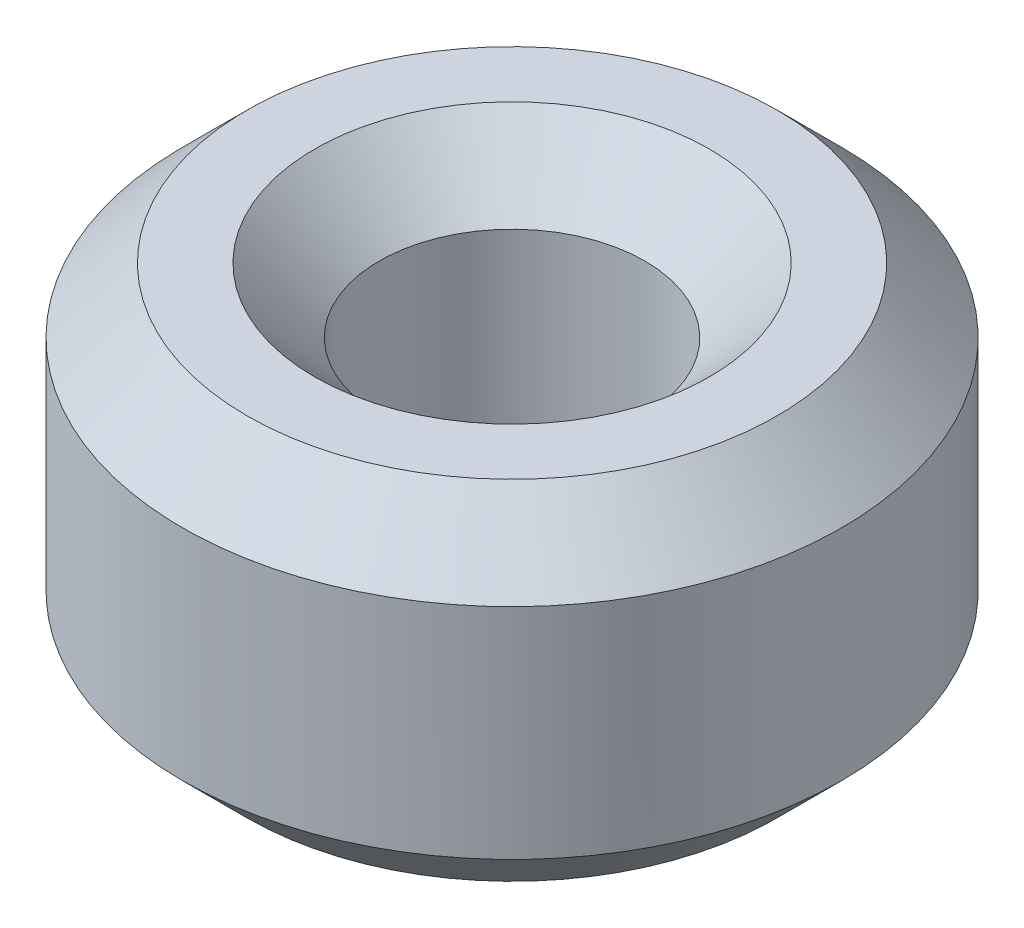
ISO-10303-21;
HEADER;
FILE_DESCRIPTION(('STEP AP214'),'2;1');
FILE_NAME('part.step','',(''),(''),'','','');
FILE_SCHEMA(('AUTOMOTIVE_DESIGN { 1 0 10303 214 1 1 1 1 }'));
ENDSEC;
DATA;
#1=APPLICATION_CONTEXT('core data for automotive mechanical design processes');
#2=APPLICATION_PROTOCOL_DEFINITION('international standard','automotive_design',2000,#1);
#3=PRODUCT_CONTEXT('',#1,'mechanical');
#4=PRODUCT('Part','Part','',(#3));
#5=PRODUCT_RELATED_PRODUCT_CATEGORY('part','',(#4));
#6=PRODUCT_DEFINITION_FORMATION('','',#4);
#7=PRODUCT_DEFINITION_CONTEXT('part definition',#1,'design');
#8=PRODUCT_DEFINITION('design','',#6,#7);
#9=PRODUCT_DEFINITION_SHAPE('','',#8);
#10=(LENGTH_UNIT() NAMED_UNIT(*) SI_UNIT(.MILLI.,.METRE.));
#11=(NAMED_UNIT(*) PLANE_ANGLE_UNIT() SI_UNIT($,.RADIAN.));
#12=(NAMED_UNIT(*) SI_UNIT($,.STERADIAN.) SOLID_ANGLE_UNIT());
#13=UNCERTAINTY_MEASURE_WITH_UNIT(LENGTH_MEASURE(1.E-05),#10,'distance_accuracy_value','');
#14=(GEOMETRIC_REPRESENTATION_CONTEXT(3) GLOBAL_UNCERTAINTY_ASSIGNED_CONTEXT((#13)) GLOBAL_UNIT_ASSIGNED_CONTEXT((#10,
#11,#12)) REPRESENTATION_CONTEXT('',''));
#15=CARTESIAN_POINT('',(0.,0.,0.));
#16=DIRECTION('',(0.,0.,1.));
#17=DIRECTION('',(1.,0.,0.));
#18=AXIS2_PLACEMENT_3D('',#15,#16,#17);
#19=CARTESIAN_POINT('',(0.,18.4886831426809,0.));
#20=DIRECTION('',(0.,-1.,0.));
#21=DIRECTION('',(0.,0.,-1.));
#22=AXIS2_PLACEMENT_3D('',#19,#20,#21);
#23=CYLINDRICAL_SURFACE('',#22,17.5);
#24=CARTESIAN_POINT('',(0.,3.43177718561579,0.));
#25=DIRECTION('',(0.,1.,0.));
#26=DIRECTION('',(0.,0.,1.));
#27=AXIS2_PLACEMENT_3D('',#24,#25,#26);
#28=CIRCLE('',#27,17.5);
#29=CARTESIAN_POINT('',(0.,3.43177718561579,-17.5));
#30=VERTEX_POINT('',#29);
#31=EDGE_CURVE('E10',#30,#30,#28,.T.);
#32=CARTESIAN_POINT('',(0.,15.0569059570651,0.));
#33=DIRECTION('',(0.,1.,0.));
#34=DIRECTION('',(0.,0.,1.));
#35=AXIS2_PLACEMENT_3D('',#32,#33,#34);
#36=CIRCLE('',#35,17.5);
#37=CARTESIAN_POINT('',(0.,15.0569059570651,-17.5));
#38=VERTEX_POINT('',#37);
#39=EDGE_CURVE('E50',#38,#38,#36,.F.);
#40=CARTESIAN_POINT('',(0.,3.43177718561579,-17.5));
#41=CARTESIAN_POINT('',(0.,3.55287227698505,-17.5));
#42=CARTESIAN_POINT('',(0.,3.67396736835431,-17.5));
#43=CARTESIAN_POINT('',(0.,3.91615755109284,-17.5));
#44=CARTESIAN_POINT('',(0.,4.03725264246211,-17.5));
#45=CARTESIAN_POINT('',(0.,4.27944282520063,-17.5));
#46=CARTESIAN_POINT('',(0.,4.4005379165699,-17.5));
#47=CARTESIAN_POINT('',(0.,4.64272809930843,-17.5));
#48=CARTESIAN_POINT('',(0.,4.76382319067769,-17.5));
#49=CARTESIAN_POINT('',(0.,5.00601337341622,-17.5));
#50=CARTESIAN_POINT('',(0.,5.12710846478548,-17.5));
#51=CARTESIAN_POINT('',(0.,5.36929864752401,-17.5));
#52=CARTESIAN_POINT('',(0.,5.49039373889327,-17.5));
#53=CARTESIAN_POINT('',(0.,5.7325839216318,-17.5));
#54=CARTESIAN_POINT('',(0.,5.85367901300106,-17.5));
#55=CARTESIAN_POINT('',(0.,6.09586919573959,-17.5));
#56=CARTESIAN_POINT('',(0.,6.21696428710886,-17.5));
#57=CARTESIAN_POINT('',(0.,6.45915446984738,-17.5));
#58=CARTESIAN_POINT('',(0.,6.58024956121665,-17.5));
#59=CARTESIAN_POINT('',(0.,6.82243974395518,-17.5));
#60=CARTESIAN_POINT('',(0.,6.94353483532444,-17.5));
#61=CARTESIAN_POINT('',(0.,7.18572501806297,-17.5));
#62=CARTESIAN_POINT('',(0.,7.30682010943223,-17.5));
#63=CARTESIAN_POINT('',(0.,7.54901029217076,-17.5));
#64=CARTESIAN_POINT('',(0.,7.67010538354002,-17.5));
#65=CARTESIAN_POINT('',(0.,7.91229556627855,-17.5));
#66=CARTESIAN_POINT('',(0.,8.03339065764782,-17.5));
#67=CARTESIAN_POINT('',(0.,8.27558084038635,-17.5));
#68=CARTESIAN_POINT('',(0.,8.39667593175561,-17.5));
#69=CARTESIAN_POINT('',(0.,8.63886611449414,-17.5));
#70=CARTESIAN_POINT('',(0.,8.7599612058634,-17.5));
#71=CARTESIAN_POINT('',(0.,9.00215138860193,-17.5));
#72=CARTESIAN_POINT('',(0.,9.12324647997119,-17.5));
#73=CARTESIAN_POINT('',(0.,9.36543666270972,-17.5));
#74=CARTESIAN_POINT('',(0.,9.48653175407899,-17.5));
#75=CARTESIAN_POINT('',(0.,9.72872193681751,-17.5));
#76=CARTESIAN_POINT('',(0.,9.84981702818678,-17.5));
#77=CARTESIAN_POINT('',(0.,10.0920072109253,-17.5));
#78=CARTESIAN_POINT('',(0.,10.2131023022946,-17.5));
#79=CARTESIAN_POINT('',(0.,10.4552924850331,-17.5));
#80=CARTESIAN_POINT('',(0.,10.5763875764024,-17.5));
#81=CARTESIAN_POINT('',(0.,10.8185777591409,-17.5));
#82=CARTESIAN_POINT('',(0.,10.9396728505102,-17.5));
#83=CARTESIAN_POINT('',(0.,11.1818630332487,-17.5));
#84=CARTESIAN_POINT('',(0.,11.3029581246179,-17.5));
#85=CARTESIAN_POINT('',(0.,11.5451483073565,-17.5));
#86=CARTESIAN_POINT('',(0.,11.6662433987257,-17.5));
#87=CARTESIAN_POINT('',(0.,11.9084335814643,-17.5));
#88=CARTESIAN_POINT('',(0.,12.0295286728335,-17.5));
#89=CARTESIAN_POINT('',(0.,12.2717188555721,-17.5));
#90=CARTESIAN_POINT('',(0.,12.3928139469413,-17.5));
#91=CARTESIAN_POINT('',(0.,12.6350041296798,-17.5));
#92=CARTESIAN_POINT('',(0.,12.7560992210491,-17.5));
#93=CARTESIAN_POINT('',(0.,12.9982894037876,-17.5));
#94=CARTESIAN_POINT('',(0.,13.1193844951569,-17.5));
#95=CARTESIAN_POINT('',(0.,13.3615746778954,-17.5));
#96=CARTESIAN_POINT('',(0.,13.4826697692647,-17.5));
#97=CARTESIAN_POINT('',(0.,13.7248599520032,-17.5));
#98=CARTESIAN_POINT('',(0.,13.8459550433725,-17.5));
#99=CARTESIAN_POINT('',(0.,14.088145226111,-17.5));
#100=CARTESIAN_POINT('',(0.,14.2092403174803,-17.5));
#101=CARTESIAN_POINT('',(0.,14.4514305002188,-17.5));
#102=CARTESIAN_POINT('',(0.,14.5725255915881,-17.5));
#103=CARTESIAN_POINT('',(0.,14.8147157743266,-17.5));
#104=CARTESIAN_POINT('',(0.,14.9358108656959,-17.5));
#105=CARTESIAN_POINT('',(0.,15.0569059570651,-17.5));
#106=B_SPLINE_CURVE_WITH_KNOTS('',3,(#40,#41,#42,#43,#44,#45,#46,#47,#48,#49,#50,#51,#52,#53,
#54,#55,#56,#57,#58,#59,#60,#61,#62,#63,#64,#65,#66,#67,#68,#69,#70,#71,#72,#73,#74,#75,#76,#77,
#78,#79,#80,#81,#82,#83,#84,#85,#86,#87,#88,#89,#90,#91,#92,#93,#94,#95,#96,#97,#98,#99,#100,
#101,#102,#103,#104,#105),.UNSPECIFIED.,.F.,.F.,(4,2,2,2,2,2,2,2,2,2,2,2,2,2,2,2,2,2,2,2,2,2,2,
2,2,2,2,2,2,2,2,2,4),(0.,0.363285274107792,0.726570548215583,1.08985582232338,1.45314109643117,
1.81642637053896,2.17971164464675,2.54299691875454,2.90628219286234,3.26956746697013,
3.63285274107792,3.99613801518571,4.3594232892935,4.7227085634013,5.08599383750909,
5.44927911161688,5.81256438572467,6.17584965983246,6.53913493394026,6.90242020804805,
7.26570548215584,7.62899075626363,7.99227603037142,8.35556130447921,8.71884657858701,
9.0821318526948,9.44541712680259,9.80870240091038,10.1719876750182,10.535272949126,
10.8985582232338,11.2618434973415,11.6251287714493),.UNSPECIFIED.);
#107=EDGE_CURVE('BSEAM39',#30,#38,#106,.T.);
#108=ORIENTED_EDGE('',*,*,#31,.T.);
#109=ORIENTED_EDGE('',*,*,#39,.T.);
#110=ORIENTED_EDGE('',*,*,#107,.T.);
#111=ORIENTED_EDGE('',*,*,#107,.F.);
#112=EDGE_LOOP('',(#108,#110,#109,#111));
#113=FACE_BOUND('',#112,.T.);
#114=ADVANCED_FACE('F39',(#113),#23,.T.);
#115=CARTESIAN_POINT('',(0.,18.4886831426809,0.));
#116=DIRECTION('',(0.,1.,0.));
#117=DIRECTION('',(0.,0.,1.));
#118=AXIS2_PLACEMENT_3D('',#115,#116,#117);
#119=PLANE('',#118);
#120=CARTESIAN_POINT('',(0.,18.4886831426809,0.));
#121=DIRECTION('',(0.,1.,0.));
#122=DIRECTION('',(0.,0.,1.));
#123=AXIS2_PLACEMENT_3D('',#120,#121,#122);
#124=CIRCLE('',#123,10.4819727118221);
#125=CARTESIAN_POINT('',(0.,18.4886831426809,10.4819727118221));
#126=VERTEX_POINT('',#125);
#127=EDGE_CURVE('E58',#126,#126,#124,.F.);
#128=ORIENTED_EDGE('',*,*,#127,.T.);
#129=EDGE_LOOP('',(#128));
#130=FACE_BOUND('',#129,.T.);
#131=CARTESIAN_POINT('',(0.,18.4886831426809,0.));
#132=DIRECTION('',(0.,1.,0.));
#133=DIRECTION('',(0.,0.,1.));
#134=AXIS2_PLACEMENT_3D('',#131,#132,#133);
#135=CIRCLE('',#134,14.0682228143843);
#136=CARTESIAN_POINT('',(0.,18.4886831426809,14.0682228143843));
#137=VERTEX_POINT('',#136);
#138=EDGE_CURVE('E61',#137,#137,#135,.T.);
#139=ORIENTED_EDGE('',*,*,#138,.T.);
#140=EDGE_LOOP('',(#139));
#141=FACE_BOUND('',#140,.T.);
#142=ADVANCED_FACE('F88',(#130,#141),#119,.T.);
#143=CARTESIAN_POINT('',(0.,0.,0.));
#144=DIRECTION('',(0.,1.,0.));
#145=DIRECTION('',(0.,0.,1.));
#146=AXIS2_PLACEMENT_3D('',#143,#144,#145);
#147=PLANE('',#146);
#148=CARTESIAN_POINT('',(0.,0.,0.));
#149=DIRECTION('',(0.,1.,0.));
#150=DIRECTION('',(0.,0.,1.));
#151=AXIS2_PLACEMENT_3D('',#148,#149,#150);
#152=CIRCLE('',#151,10.481972711822);
#153=CARTESIAN_POINT('',(0.,0.,10.481972711822));
#154=VERTEX_POINT('',#153);
#155=EDGE_CURVE('E51',#154,#154,#152,.T.);
#156=ORIENTED_EDGE('',*,*,#155,.T.);
#157=EDGE_LOOP('',(#156));
#158=FACE_BOUND('',#157,.T.);
#159=CARTESIAN_POINT('',(0.,0.,0.));
#160=DIRECTION('',(0.,1.,0.));
#161=DIRECTION('',(0.,0.,1.));
#162=AXIS2_PLACEMENT_3D('',#159,#160,#161);
#163=CIRCLE('',#162,14.0682228143842);
#164=CARTESIAN_POINT('',(0.,0.,14.0682228143842));
#165=VERTEX_POINT('',#164);
#166=EDGE_CURVE('E54',#165,#165,#163,.F.);
#167=ORIENTED_EDGE('',*,*,#166,.T.);
#168=EDGE_LOOP('',(#167));
#169=FACE_BOUND('',#168,.T.);
#170=ADVANCED_FACE('F83',(#158,#169),#147,.F.);
#171=CARTESIAN_POINT('',(0.,18.4886831426809,0.));
#172=DIRECTION('',(0.,-1.,0.));
#173=DIRECTION('',(0.,0.,-1.));
#174=AXIS2_PLACEMENT_3D('',#171,#172,#173);
#175=CYLINDRICAL_SURFACE('',#174,7.05019552620628);
#176=CARTESIAN_POINT('',(0.,15.0569059570651,0.));
#177=DIRECTION('',(0.,1.,0.));
#178=DIRECTION('',(0.,0.,1.));
#179=AXIS2_PLACEMENT_3D('',#176,#177,#178);
#180=CIRCLE('',#179,7.05019552620628);
#181=CARTESIAN_POINT('',(0.,15.0569059570651,-7.05019552620628));
#182=VERTEX_POINT('',#181);
#183=EDGE_CURVE('E67',#182,#182,#180,.T.);
#184=CARTESIAN_POINT('',(0.,3.43177718561576,0.));
#185=DIRECTION('',(0.,1.,0.));
#186=DIRECTION('',(0.,0.,1.));
#187=AXIS2_PLACEMENT_3D('',#184,#185,#186);
#188=CIRCLE('',#187,7.05019552620628);
#189=CARTESIAN_POINT('',(0.,3.43177718561576,-7.05019552620628));
#190=VERTEX_POINT('',#189);
#191=EDGE_CURVE('E69',#190,#190,#188,.F.);
#192=CARTESIAN_POINT('',(0.,15.0569059570651,-7.05019552620628));
#193=CARTESIAN_POINT('',(0.,14.9358108656958,-7.05019552620628));
#194=CARTESIAN_POINT('',(0.,14.8147157743266,-7.05019552620628));
#195=CARTESIAN_POINT('',(0.,14.572525591588,-7.05019552620628));
#196=CARTESIAN_POINT('',(0.,14.4514305002188,-7.05019552620628));
#197=CARTESIAN_POINT('',(0.,14.2092403174802,-7.05019552620628));
#198=CARTESIAN_POINT('',(0.,14.088145226111,-7.05019552620628));
#199=CARTESIAN_POINT('',(0.,13.8459550433725,-7.05019552620628));
#200=CARTESIAN_POINT('',(0.,13.7248599520032,-7.05019552620628));
#201=CARTESIAN_POINT('',(0.,13.4826697692647,-7.05019552620628));
#202=CARTESIAN_POINT('',(0.,13.3615746778954,-7.05019552620628));
#203=CARTESIAN_POINT('',(0.,13.1193844951569,-7.05019552620628));
#204=CARTESIAN_POINT('',(0.,12.9982894037876,-7.05019552620628));
#205=CARTESIAN_POINT('',(0.,12.7560992210491,-7.05019552620628));
#206=CARTESIAN_POINT('',(0.,12.6350041296798,-7.05019552620628));
#207=CARTESIAN_POINT('',(0.,12.3928139469413,-7.05019552620628));
#208=CARTESIAN_POINT('',(0.,12.271718855572,-7.05019552620628));
#209=CARTESIAN_POINT('',(0.,12.0295286728335,-7.05019552620628));
#210=CARTESIAN_POINT('',(0.,11.9084335814642,-7.05019552620628));
#211=CARTESIAN_POINT('',(0.,11.6662433987257,-7.05019552620628));
#212=CARTESIAN_POINT('',(0.,11.5451483073564,-7.05019552620628));
#213=CARTESIAN_POINT('',(0.,11.3029581246179,-7.05019552620628));
#214=CARTESIAN_POINT('',(0.,11.1818630332486,-7.05019552620628));
#215=CARTESIAN_POINT('',(0.,10.9396728505101,-7.05019552620628));
#216=CARTESIAN_POINT('',(0.,10.8185777591409,-7.05019552620628));
#217=CARTESIAN_POINT('',(0.,10.5763875764023,-7.05019552620628));
#218=CARTESIAN_POINT('',(0.,10.4552924850331,-7.05019552620628));
#219=CARTESIAN_POINT('',(0.,10.2131023022945,-7.05019552620628));
#220=CARTESIAN_POINT('',(0.,10.0920072109253,-7.05019552620628));
#221=CARTESIAN_POINT('',(0.,9.84981702818675,-7.05019552620628));
#222=CARTESIAN_POINT('',(0.,9.72872193681748,-7.05019552620628));
#223=CARTESIAN_POINT('',(0.,9.48653175407895,-7.05019552620628));
#224=CARTESIAN_POINT('',(0.,9.36543666270969,-7.05019552620628));
#225=CARTESIAN_POINT('',(0.,9.12324647997116,-7.05019552620628));
#226=CARTESIAN_POINT('',(0.,9.0021513886019,-7.05019552620628));
#227=CARTESIAN_POINT('',(0.,8.75996120586337,-7.05019552620628));
#228=CARTESIAN_POINT('',(0.,8.63886611449411,-7.05019552620628));
#229=CARTESIAN_POINT('',(0.,8.39667593175558,-7.05019552620628));
#230=CARTESIAN_POINT('',(0.,8.27558084038631,-7.05019552620628));
#231=CARTESIAN_POINT('',(0.,8.03339065764779,-7.05019552620628));
#232=CARTESIAN_POINT('',(0.,7.91229556627852,-7.05019552620628));
#233=CARTESIAN_POINT('',(0.,7.67010538354,-7.05019552620628));
#234=CARTESIAN_POINT('',(0.,7.54901029217073,-7.05019552620628));
#235=CARTESIAN_POINT('',(0.,7.3068201094322,-7.05019552620628));
#236=CARTESIAN_POINT('',(0.,7.18572501806294,-7.05019552620628));
#237=CARTESIAN_POINT('',(0.,6.94353483532441,-7.05019552620628));
#238=CARTESIAN_POINT('',(0.,6.82243974395515,-7.05019552620628));
#239=CARTESIAN_POINT('',(0.,6.58024956121662,-7.05019552620628));
#240=CARTESIAN_POINT('',(0.,6.45915446984736,-7.05019552620628));
#241=CARTESIAN_POINT('',(0.,6.21696428710883,-7.05019552620628));
#242=CARTESIAN_POINT('',(0.,6.09586919573956,-7.05019552620628));
#243=CARTESIAN_POINT('',(0.,5.85367901300104,-7.05019552620628));
#244=CARTESIAN_POINT('',(0.,5.73258392163177,-7.05019552620628));
#245=CARTESIAN_POINT('',(0.,5.49039373889325,-7.05019552620628));
#246=CARTESIAN_POINT('',(0.,5.36929864752398,-7.05019552620628));
#247=CARTESIAN_POINT('',(0.,5.12710846478546,-7.05019552620628));
#248=CARTESIAN_POINT('',(0.,5.00601337341619,-7.05019552620628));
#249=CARTESIAN_POINT('',(0.,4.76382319067766,-7.05019552620628));
#250=CARTESIAN_POINT('',(0.,4.6427280993084,-7.05019552620628));
#251=CARTESIAN_POINT('',(0.,4.40053791656987,-7.05019552620628));
#252=CARTESIAN_POINT('',(0.,4.27944282520061,-7.05019552620628));
#253=CARTESIAN_POINT('',(0.,4.03725264246208,-7.05019552620628));
#254=CARTESIAN_POINT('',(0.,3.91615755109282,-7.05019552620628));
#255=CARTESIAN_POINT('',(0.,3.67396736835429,-7.05019552620628));
#256=CARTESIAN_POINT('',(0.,3.55287227698502,-7.05019552620628));
#257=CARTESIAN_POINT('',(0.,3.43177718561576,-7.05019552620628));
#258=B_SPLINE_CURVE_WITH_KNOTS('',3,(#192,#193,#194,#195,#196,#197,#198,#199,#200,#201,#202,
#203,#204,#205,#206,#207,#208,#209,#210,#211,#212,#213,#214,#215,#216,#217,#218,#219,#220,#221,
#222,#223,#224,#225,#226,#227,#228,#229,#230,#231,#232,#233,#234,#235,#236,#237,#238,#239,#240,
#241,#242,#243,#244,#245,#246,#247,#248,#249,#250,#251,#252,#253,#254,#255,#256,#257),
.UNSPECIFIED.,.F.,.F.,(4,2,2,2,2,2,2,2,2,2,2,2,2,2,2,2,2,2,2,2,2,2,2,2,2,2,2,2,2,2,2,2,4),(0.,
0.363285274107792,0.726570548215582,1.08985582232337,1.45314109643116,1.81642637053896,
2.17971164464675,2.54299691875454,2.90628219286233,3.26956746697012,3.63285274107791,
3.9961380151857,4.3594232892935,4.72270856340129,5.08599383750908,5.44927911161687,
5.81256438572466,6.17584965983245,6.53913493394025,6.90242020804804,7.26570548215583,
7.62899075626362,7.99227603037141,8.3555613044792,8.71884657858699,9.08213185269479,
9.44541712680258,9.80870240091037,10.1719876750182,10.535272949126,10.8985582232337,
11.2618434973415,11.6251287714493),.UNSPECIFIED.);
#259=EDGE_CURVE('BSEAM71',#182,#190,#258,.T.);
#260=ORIENTED_EDGE('',*,*,#183,.T.);
#261=ORIENTED_EDGE('',*,*,#191,.T.);
#262=ORIENTED_EDGE('',*,*,#259,.T.);
#263=ORIENTED_EDGE('',*,*,#259,.F.);
#264=EDGE_LOOP('',(#260,#262,#261,#263));
#265=FACE_BOUND('',#264,.T.);
#266=ADVANCED_FACE('F71',(#265),#175,.F.);
#267=CARTESIAN_POINT('',(0.,15.0569059570651,0.));
#268=DIRECTION('',(0.,1.,0.));
#269=DIRECTION('',(0.,0.,1.));
#270=AXIS2_PLACEMENT_3D('',#267,#268,#269);
#271=CONICAL_SURFACE('',#270,7.05019552620628,0.785398163397451);
#272=ORIENTED_EDGE('',*,*,#127,.F.);
#273=EDGE_LOOP('',(#272));
#274=FACE_BOUND('',#273,.T.);
#275=ORIENTED_EDGE('',*,*,#183,.F.);
#276=EDGE_LOOP('',(#275));
#277=FACE_BOUND('',#276,.T.);
#278=ADVANCED_FACE('F77',(#274,#277),#271,.F.);
#279=CARTESIAN_POINT('',(0.,0.,0.));
#280=DIRECTION('',(0.,-1.,0.));
#281=DIRECTION('',(0.,0.,-1.));
#282=AXIS2_PLACEMENT_3D('',#279,#280,#281);
#283=CONICAL_SURFACE('',#282,10.481972711822,0.785398163397445);
#284=ORIENTED_EDGE('',*,*,#191,.F.);
#285=EDGE_LOOP('',(#284));
#286=FACE_BOUND('',#285,.T.);
#287=ORIENTED_EDGE('',*,*,#155,.F.);
#288=EDGE_LOOP('',(#287));
#289=FACE_BOUND('',#288,.T.);
#290=ADVANCED_FACE('F73',(#286,#289),#283,.F.);
#291=CARTESIAN_POINT('',(0.,3.43177718561579,0.));
#292=DIRECTION('',(0.,1.,0.));
#293=DIRECTION('',(0.,0.,1.));
#294=AXIS2_PLACEMENT_3D('',#291,#292,#293);
#295=CONICAL_SURFACE('',#294,17.5,0.785398163397452);
#296=ORIENTED_EDGE('',*,*,#166,.F.);
#297=EDGE_LOOP('',(#296));
#298=FACE_BOUND('',#297,.T.);
#299=ORIENTED_EDGE('',*,*,#31,.F.);
#300=EDGE_LOOP('',(#299));
#301=FACE_BOUND('',#300,.T.);
#302=ADVANCED_FACE('F76',(#298,#301),#295,.T.);
#303=CARTESIAN_POINT('',(0.,18.4886831426809,0.));
#304=DIRECTION('',(0.,-1.,0.));
#305=DIRECTION('',(0.,0.,-1.));
#306=AXIS2_PLACEMENT_3D('',#303,#304,#305);
#307=CONICAL_SURFACE('',#306,14.0682228143843,0.785398163397445);
#308=ORIENTED_EDGE('',*,*,#39,.F.);
#309=EDGE_LOOP('',(#308));
#310=FACE_BOUND('',#309,.T.);
#311=ORIENTED_EDGE('',*,*,#138,.F.);
#312=EDGE_LOOP('',(#311));
#313=FACE_BOUND('',#312,.T.);
#314=ADVANCED_FACE('F45',(#310,#313),#307,.T.);
#315=CLOSED_SHELL('',(#114,#142,#170,#266,#278,#290,#302,#314));
#316=MANIFOLD_SOLID_BREP('B2',#315);
#317=ADVANCED_BREP_SHAPE_REPRESENTATION('',(#18,#316),#14);
#318=SHAPE_DEFINITION_REPRESENTATION(#9,#317);
ENDSEC;
END-ISO-10303-21;
